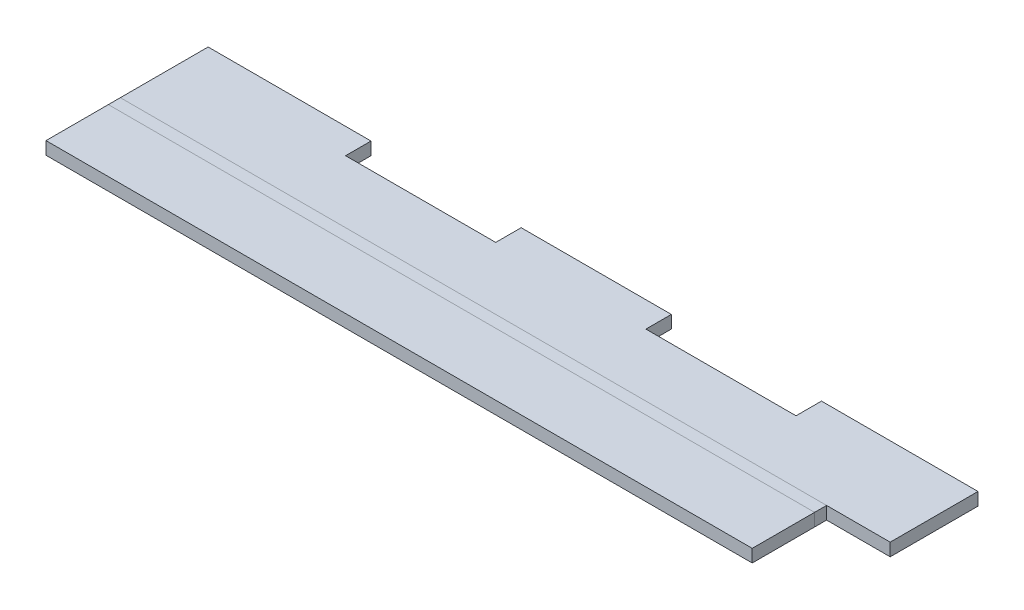
ISO-10303-21;
HEADER;
FILE_DESCRIPTION(('STEP AP214'),'2;1');
FILE_NAME('part.step','',(''),(''),'','','');
FILE_SCHEMA(('AUTOMOTIVE_DESIGN { 1 0 10303 214 1 1 1 1 }'));
ENDSEC;
DATA;
#1=APPLICATION_CONTEXT('core data for automotive mechanical design processes');
#2=APPLICATION_PROTOCOL_DEFINITION('international standard','automotive_design',2000,#1);
#3=PRODUCT_CONTEXT('',#1,'mechanical');
#4=PRODUCT('Part','Part','',(#3));
#5=PRODUCT_RELATED_PRODUCT_CATEGORY('part','',(#4));
#6=PRODUCT_DEFINITION_FORMATION('','',#4);
#7=PRODUCT_DEFINITION_CONTEXT('part definition',#1,'design');
#8=PRODUCT_DEFINITION('design','',#6,#7);
#9=PRODUCT_DEFINITION_SHAPE('','',#8);
#10=(LENGTH_UNIT() NAMED_UNIT(*) SI_UNIT(.MILLI.,.METRE.));
#11=(NAMED_UNIT(*) PLANE_ANGLE_UNIT() SI_UNIT($,.RADIAN.));
#12=(NAMED_UNIT(*) SI_UNIT($,.STERADIAN.) SOLID_ANGLE_UNIT());
#13=UNCERTAINTY_MEASURE_WITH_UNIT(LENGTH_MEASURE(1.E-05),#10,'distance_accuracy_value','');
#14=(GEOMETRIC_REPRESENTATION_CONTEXT(3) GLOBAL_UNCERTAINTY_ASSIGNED_CONTEXT((#13)) GLOBAL_UNIT_ASSIGNED_CONTEXT((#10,
#11,#12)) REPRESENTATION_CONTEXT('',''));
#15=CARTESIAN_POINT('',(0.,0.,0.));
#16=DIRECTION('',(0.,0.,1.));
#17=DIRECTION('',(1.,0.,0.));
#18=AXIS2_PLACEMENT_3D('',#15,#16,#17);
#19=CARTESIAN_POINT('',(7.6835,2.032,-1.96658936020354));
#20=DIRECTION('',(1.,0.,0.));
#21=DIRECTION('',(0.,0.,1.));
#22=AXIS2_PLACEMENT_3D('',#19,#20,#21);
#23=PLANE('',#22);
#24=DIRECTION('',(0.,1.,0.));
#25=VECTOR('',#24,1.);
#26=CARTESIAN_POINT('',(7.6835,2.032,-0.213989360203542));
#27=LINE('',#26,#25);
#28=CARTESIAN_POINT('',(7.6835,1.778,-0.213989360203542));
#29=VERTEX_POINT('',#28);
#30=CARTESIAN_POINT('',(7.6835,2.032,-0.213989360203542));
#31=VERTEX_POINT('',#30);
#32=EDGE_CURVE('E304',#29,#31,#27,.T.);
#33=ORIENTED_EDGE('',*,*,#32,.F.);
#34=DIRECTION('',(0.,0.,1.));
#35=VECTOR('',#34,1.);
#36=CARTESIAN_POINT('',(7.6835,1.778,-1.96658936020354));
#37=LINE('',#36,#35);
#38=CARTESIAN_POINT('',(7.6835,1.778,-1.96658936020354));
#39=VERTEX_POINT('',#38);
#40=EDGE_CURVE('E282',#39,#29,#37,.T.);
#41=ORIENTED_EDGE('',*,*,#40,.F.);
#42=DIRECTION('',(0.,1.,0.));
#43=VECTOR('',#42,1.);
#44=CARTESIAN_POINT('',(7.6835,2.032,-1.96658936020354));
#45=LINE('',#44,#43);
#46=CARTESIAN_POINT('',(7.6835,2.032,-1.96658936020354));
#47=VERTEX_POINT('',#46);
#48=EDGE_CURVE('E302',#39,#47,#45,.T.);
#49=ORIENTED_EDGE('',*,*,#48,.T.);
#50=DIRECTION('',(0.,0.,1.));
#51=VECTOR('',#50,1.);
#52=CARTESIAN_POINT('',(7.6835,2.032,-1.96658936020354));
#53=LINE('',#52,#51);
#54=EDGE_CURVE('E243',#47,#31,#53,.T.);
#55=ORIENTED_EDGE('',*,*,#54,.T.);
#56=EDGE_LOOP('',(#33,#41,#49,#55));
#57=FACE_BOUND('',#56,.T.);
#58=ADVANCED_FACE('F41',(#57),#23,.T.);
#59=CARTESIAN_POINT('',(7.6835,2.032,-1.96658936020354));
#60=DIRECTION('',(0.,0.,1.));
#61=DIRECTION('',(-1.,0.,0.));
#62=AXIS2_PLACEMENT_3D('',#59,#60,#61);
#63=PLANE('',#62);
#64=ORIENTED_EDGE('',*,*,#48,.F.);
#65=DIRECTION('',(1.,0.,0.));
#66=VECTOR('',#65,1.);
#67=CARTESIAN_POINT('',(7.6835,1.778,-1.96658936020354));
#68=LINE('',#67,#66);
#69=CARTESIAN_POINT('',(4.55929999999997,1.778,-1.96658936020354));
#70=VERTEX_POINT('',#69);
#71=EDGE_CURVE('E279',#39,#70,#68,.F.);
#72=ORIENTED_EDGE('',*,*,#71,.T.);
#73=DIRECTION('',(0.,1.,0.));
#74=VECTOR('',#73,1.);
#75=CARTESIAN_POINT('',(4.55929999999997,2.032,-1.96658936020354));
#76=LINE('',#75,#74);
#77=CARTESIAN_POINT('',(4.55929999999997,2.032,-1.96658936020354));
#78=VERTEX_POINT('',#77);
#79=EDGE_CURVE('E300',#70,#78,#76,.T.);
#80=ORIENTED_EDGE('',*,*,#79,.T.);
#81=DIRECTION('',(-1.,0.,0.));
#82=VECTOR('',#81,1.);
#83=CARTESIAN_POINT('',(7.6835,2.032,-1.96658936020354));
#84=LINE('',#83,#82);
#85=EDGE_CURVE('E230',#47,#78,#84,.T.);
#86=ORIENTED_EDGE('',*,*,#85,.F.);
#87=EDGE_LOOP('',(#64,#72,#80,#86));
#88=FACE_BOUND('',#87,.T.);
#89=ADVANCED_FACE('F339',(#88),#63,.F.);
#90=CARTESIAN_POINT('',(4.55929999999997,2.032,-1.96658936020354));
#91=DIRECTION('',(-1.,0.,0.));
#92=DIRECTION('',(0.,0.,-1.));
#93=AXIS2_PLACEMENT_3D('',#90,#91,#92);
#94=PLANE('',#93);
#95=ORIENTED_EDGE('',*,*,#79,.F.);
#96=DIRECTION('',(0.,0.,1.));
#97=VECTOR('',#96,1.);
#98=CARTESIAN_POINT('',(4.55929999999997,1.778,-1.96658936020354));
#99=LINE('',#98,#97);
#100=CARTESIAN_POINT('',(4.55929999999997,1.778,-1.45858936020354));
#101=VERTEX_POINT('',#100);
#102=EDGE_CURVE('E276',#101,#70,#99,.F.);
#103=ORIENTED_EDGE('',*,*,#102,.F.);
#104=DIRECTION('',(0.,1.,0.));
#105=VECTOR('',#104,1.);
#106=CARTESIAN_POINT('',(4.55929999999997,2.032,-1.45858936020354));
#107=LINE('',#106,#105);
#108=CARTESIAN_POINT('',(4.55929999999997,2.032,-1.45858936020354));
#109=VERTEX_POINT('',#108);
#110=EDGE_CURVE('E298',#101,#109,#107,.T.);
#111=ORIENTED_EDGE('',*,*,#110,.T.);
#112=DIRECTION('',(0.,0.,-1.));
#113=VECTOR('',#112,1.);
#114=CARTESIAN_POINT('',(4.55929999999997,2.032,-1.96658936020354));
#115=LINE('',#114,#113);
#116=EDGE_CURVE('E246',#109,#78,#115,.T.);
#117=ORIENTED_EDGE('',*,*,#116,.T.);
#118=EDGE_LOOP('',(#95,#103,#111,#117));
#119=FACE_BOUND('',#118,.T.);
#120=ADVANCED_FACE('F344',(#119),#94,.T.);
#121=CARTESIAN_POINT('',(4.55929999999997,2.032,-1.45858936020354));
#122=DIRECTION('',(0.,0.,-1.));
#123=DIRECTION('',(1.,0.,0.));
#124=AXIS2_PLACEMENT_3D('',#121,#122,#123);
#125=PLANE('',#124);
#126=ORIENTED_EDGE('',*,*,#110,.F.);
#127=DIRECTION('',(1.,0.,0.));
#128=VECTOR('',#127,1.);
#129=CARTESIAN_POINT('',(7.6835,1.778,-1.45858936020354));
#130=LINE('',#129,#128);
#131=CARTESIAN_POINT('',(1.56209999999997,1.778,-1.45858936020354));
#132=VERTEX_POINT('',#131);
#133=EDGE_CURVE('E273',#132,#101,#130,.T.);
#134=ORIENTED_EDGE('',*,*,#133,.F.);
#135=DIRECTION('',(0.,1.,0.));
#136=VECTOR('',#135,1.);
#137=CARTESIAN_POINT('',(1.56209999999997,2.032,-1.45858936020354));
#138=LINE('',#137,#136);
#139=CARTESIAN_POINT('',(1.56209999999997,2.032,-1.45858936020354));
#140=VERTEX_POINT('',#139);
#141=EDGE_CURVE('E296',#132,#140,#138,.T.);
#142=ORIENTED_EDGE('',*,*,#141,.T.);
#143=DIRECTION('',(1.,0.,0.));
#144=VECTOR('',#143,1.);
#145=CARTESIAN_POINT('',(4.55929999999997,2.032,-1.45858936020354));
#146=LINE('',#145,#144);
#147=EDGE_CURVE('E249',#140,#109,#146,.T.);
#148=ORIENTED_EDGE('',*,*,#147,.T.);
#149=EDGE_LOOP('',(#126,#134,#142,#148));
#150=FACE_BOUND('',#149,.T.);
#151=ADVANCED_FACE('F352',(#150),#125,.T.);
#152=CARTESIAN_POINT('',(1.56209999999997,2.032,-1.96658936020354));
#153=DIRECTION('',(1.,0.,0.));
#154=DIRECTION('',(0.,0.,1.));
#155=AXIS2_PLACEMENT_3D('',#152,#153,#154);
#156=PLANE('',#155);
#157=ORIENTED_EDGE('',*,*,#141,.F.);
#158=DIRECTION('',(0.,0.,1.));
#159=VECTOR('',#158,1.);
#160=CARTESIAN_POINT('',(1.56209999999997,1.778,-1.96658936020354));
#161=LINE('',#160,#159);
#162=CARTESIAN_POINT('',(1.56209999999997,1.778,-1.96658936020354));
#163=VERTEX_POINT('',#162);
#164=EDGE_CURVE('E229',#163,#132,#161,.T.);
#165=ORIENTED_EDGE('',*,*,#164,.F.);
#166=DIRECTION('',(0.,1.,0.));
#167=VECTOR('',#166,1.);
#168=CARTESIAN_POINT('',(1.56209999999997,2.032,-1.96658936020354));
#169=LINE('',#168,#167);
#170=CARTESIAN_POINT('',(1.56209999999997,2.032,-1.96658936020354));
#171=VERTEX_POINT('',#170);
#172=EDGE_CURVE('E294',#163,#171,#169,.T.);
#173=ORIENTED_EDGE('',*,*,#172,.T.);
#174=DIRECTION('',(0.,0.,1.));
#175=VECTOR('',#174,1.);
#176=CARTESIAN_POINT('',(1.56209999999997,2.032,-1.96658936020354));
#177=LINE('',#176,#175);
#178=EDGE_CURVE('E252',#171,#140,#177,.T.);
#179=ORIENTED_EDGE('',*,*,#178,.T.);
#180=EDGE_LOOP('',(#157,#165,#173,#179));
#181=FACE_BOUND('',#180,.T.);
#182=ADVANCED_FACE('F356',(#181),#156,.T.);
#183=ORIENTED_EDGE('',*,*,#172,.F.);
#184=DIRECTION('',(1.,0.,0.));
#185=VECTOR('',#184,1.);
#186=CARTESIAN_POINT('',(7.6835,1.778,-1.96658936020354));
#187=LINE('',#186,#185);
#188=CARTESIAN_POINT('',(-1.43510000000003,1.778,-1.96658936020354));
#189=VERTEX_POINT('',#188);
#190=EDGE_CURVE('E212',#163,#189,#187,.F.);
#191=ORIENTED_EDGE('',*,*,#190,.T.);
#192=DIRECTION('',(0.,1.,0.));
#193=VECTOR('',#192,1.);
#194=CARTESIAN_POINT('',(-1.43510000000003,2.032,-1.96658936020354));
#195=LINE('',#194,#193);
#196=CARTESIAN_POINT('',(-1.43510000000003,2.032,-1.96658936020354));
#197=VERTEX_POINT('',#196);
#198=EDGE_CURVE('E292',#189,#197,#195,.T.);
#199=ORIENTED_EDGE('',*,*,#198,.T.);
#200=EDGE_CURVE('E225',#171,#197,#84,.T.);
#201=ORIENTED_EDGE('',*,*,#200,.F.);
#202=EDGE_LOOP('',(#183,#191,#199,#201));
#203=FACE_BOUND('',#202,.T.);
#204=ADVANCED_FACE('F347',(#203),#63,.F.);
#205=CARTESIAN_POINT('',(-1.43510000000003,2.032,-1.96658936020354));
#206=DIRECTION('',(-1.,0.,0.));
#207=DIRECTION('',(0.,0.,-1.));
#208=AXIS2_PLACEMENT_3D('',#205,#206,#207);
#209=PLANE('',#208);
#210=ORIENTED_EDGE('',*,*,#198,.F.);
#211=DIRECTION('',(0.,0.,1.));
#212=VECTOR('',#211,1.);
#213=CARTESIAN_POINT('',(-1.43510000000003,1.778,-1.96658936020354));
#214=LINE('',#213,#212);
#215=CARTESIAN_POINT('',(-1.43510000000003,1.778,-1.45858936020354));
#216=VERTEX_POINT('',#215);
#217=EDGE_CURVE('E266',#216,#189,#214,.F.);
#218=ORIENTED_EDGE('',*,*,#217,.F.);
#219=DIRECTION('',(0.,1.,0.));
#220=VECTOR('',#219,1.);
#221=CARTESIAN_POINT('',(-1.43510000000003,2.032,-1.45858936020354));
#222=LINE('',#221,#220);
#223=CARTESIAN_POINT('',(-1.43510000000003,2.032,-1.45858936020354));
#224=VERTEX_POINT('',#223);
#225=EDGE_CURVE('E290',#216,#224,#222,.T.);
#226=ORIENTED_EDGE('',*,*,#225,.T.);
#227=DIRECTION('',(0.,0.,-1.));
#228=VECTOR('',#227,1.);
#229=CARTESIAN_POINT('',(-1.43510000000003,2.032,-1.96658936020354));
#230=LINE('',#229,#228);
#231=EDGE_CURVE('E228',#224,#197,#230,.T.);
#232=ORIENTED_EDGE('',*,*,#231,.T.);
#233=EDGE_LOOP('',(#210,#218,#226,#232));
#234=FACE_BOUND('',#233,.T.);
#235=ADVANCED_FACE('F361',(#234),#209,.T.);
#236=CARTESIAN_POINT('',(-4.43230000000003,2.032,-1.45858936020354));
#237=DIRECTION('',(0.,0.,-1.));
#238=DIRECTION('',(1.,0.,0.));
#239=AXIS2_PLACEMENT_3D('',#236,#237,#238);
#240=PLANE('',#239);
#241=ORIENTED_EDGE('',*,*,#225,.F.);
#242=DIRECTION('',(1.,0.,0.));
#243=VECTOR('',#242,1.);
#244=CARTESIAN_POINT('',(7.6835,1.778,-1.45858936020354));
#245=LINE('',#244,#243);
#246=CARTESIAN_POINT('',(-4.43230000000003,1.778,-1.45858936020354));
#247=VERTEX_POINT('',#246);
#248=EDGE_CURVE('E263',#247,#216,#245,.T.);
#249=ORIENTED_EDGE('',*,*,#248,.F.);
#250=DIRECTION('',(0.,1.,0.));
#251=VECTOR('',#250,1.);
#252=CARTESIAN_POINT('',(-4.43230000000003,2.032,-1.45858936020354));
#253=LINE('',#252,#251);
#254=CARTESIAN_POINT('',(-4.43230000000003,2.032,-1.45858936020354));
#255=VERTEX_POINT('',#254);
#256=EDGE_CURVE('E288',#247,#255,#253,.T.);
#257=ORIENTED_EDGE('',*,*,#256,.T.);
#258=DIRECTION('',(1.,0.,0.));
#259=VECTOR('',#258,1.);
#260=CARTESIAN_POINT('',(-4.43230000000003,2.032,-1.45858936020354));
#261=LINE('',#260,#259);
#262=EDGE_CURVE('E234',#255,#224,#261,.T.);
#263=ORIENTED_EDGE('',*,*,#262,.T.);
#264=EDGE_LOOP('',(#241,#249,#257,#263));
#265=FACE_BOUND('',#264,.T.);
#266=ADVANCED_FACE('F364',(#265),#240,.T.);
#267=CARTESIAN_POINT('',(-4.43230000000003,2.032,-1.96658936020354));
#268=DIRECTION('',(1.,0.,0.));
#269=DIRECTION('',(0.,0.,1.));
#270=AXIS2_PLACEMENT_3D('',#267,#268,#269);
#271=PLANE('',#270);
#272=ORIENTED_EDGE('',*,*,#256,.F.);
#273=DIRECTION('',(0.,0.,1.));
#274=VECTOR('',#273,1.);
#275=CARTESIAN_POINT('',(-4.43230000000003,1.778,-1.96658936020354));
#276=LINE('',#275,#274);
#277=CARTESIAN_POINT('',(-4.43230000000003,1.778,-1.96658936020354));
#278=VERTEX_POINT('',#277);
#279=EDGE_CURVE('E260',#278,#247,#276,.T.);
#280=ORIENTED_EDGE('',*,*,#279,.F.);
#281=DIRECTION('',(0.,1.,0.));
#282=VECTOR('',#281,1.);
#283=CARTESIAN_POINT('',(-4.43230000000003,2.032,-1.96658936020354));
#284=LINE('',#283,#282);
#285=CARTESIAN_POINT('',(-4.43230000000003,2.032,-1.96658936020354));
#286=VERTEX_POINT('',#285);
#287=EDGE_CURVE('E286',#278,#286,#284,.T.);
#288=ORIENTED_EDGE('',*,*,#287,.T.);
#289=DIRECTION('',(0.,0.,1.));
#290=VECTOR('',#289,1.);
#291=CARTESIAN_POINT('',(-4.43230000000003,2.032,-1.96658936020354));
#292=LINE('',#291,#290);
#293=EDGE_CURVE('E237',#286,#255,#292,.T.);
#294=ORIENTED_EDGE('',*,*,#293,.T.);
#295=EDGE_LOOP('',(#272,#280,#288,#294));
#296=FACE_BOUND('',#295,.T.);
#297=ADVANCED_FACE('F368',(#296),#271,.T.);
#298=ORIENTED_EDGE('',*,*,#287,.F.);
#299=DIRECTION('',(1.,0.,0.));
#300=VECTOR('',#299,1.);
#301=CARTESIAN_POINT('',(7.6835,1.778,-1.96658936020354));
#302=LINE('',#301,#300);
#303=CARTESIAN_POINT('',(-7.6835,1.778,-1.96658936020354));
#304=VERTEX_POINT('',#303);
#305=EDGE_CURVE('E257',#278,#304,#302,.F.);
#306=ORIENTED_EDGE('',*,*,#305,.T.);
#307=DIRECTION('',(0.,1.,0.));
#308=VECTOR('',#307,1.);
#309=CARTESIAN_POINT('',(-7.6835,2.032,-1.96658936020354));
#310=LINE('',#309,#308);
#311=CARTESIAN_POINT('',(-7.6835,2.032,-1.96658936020354));
#312=VERTEX_POINT('',#311);
#313=EDGE_CURVE('E255',#304,#312,#310,.T.);
#314=ORIENTED_EDGE('',*,*,#313,.T.);
#315=EDGE_CURVE('E231',#286,#312,#84,.T.);
#316=ORIENTED_EDGE('',*,*,#315,.F.);
#317=EDGE_LOOP('',(#298,#306,#314,#316));
#318=FACE_BOUND('',#317,.T.);
#319=ADVANCED_FACE('F348',(#318),#63,.F.);
#320=CARTESIAN_POINT('',(-7.6835,2.032,-1.96658936020354));
#321=DIRECTION('',(1.,0.,0.));
#322=DIRECTION('',(0.,0.,1.));
#323=AXIS2_PLACEMENT_3D('',#320,#321,#322);
#324=PLANE('',#323);
#325=ORIENTED_EDGE('',*,*,#313,.F.);
#326=DIRECTION('',(0.,0.,1.));
#327=VECTOR('',#326,1.);
#328=CARTESIAN_POINT('',(-7.6835,1.778,-1.96658936020354));
#329=LINE('',#328,#327);
#330=CARTESIAN_POINT('',(-7.6835,1.778,-0.213989360203542));
#331=VERTEX_POINT('',#330);
#332=EDGE_CURVE('E65',#304,#331,#329,.T.);
#333=ORIENTED_EDGE('',*,*,#332,.T.);
#334=DIRECTION('',(0.,1.,0.));
#335=VECTOR('',#334,1.);
#336=CARTESIAN_POINT('',(-7.6835,2.032,-0.213989360203542));
#337=LINE('',#336,#335);
#338=CARTESIAN_POINT('',(-7.6835,2.032,-0.213989360203542));
#339=VERTEX_POINT('',#338);
#340=EDGE_CURVE('E307',#331,#339,#337,.T.);
#341=ORIENTED_EDGE('',*,*,#340,.T.);
#342=DIRECTION('',(0.,0.,1.));
#343=VECTOR('',#342,1.);
#344=CARTESIAN_POINT('',(-7.6835,2.032,-1.96658936020354));
#345=LINE('',#344,#343);
#346=EDGE_CURVE('E240',#312,#339,#345,.T.);
#347=ORIENTED_EDGE('',*,*,#346,.F.);
#348=EDGE_LOOP('',(#325,#333,#341,#347));
#349=FACE_BOUND('',#348,.T.);
#350=ADVANCED_FACE('F374',(#349),#324,.F.);
#351=CARTESIAN_POINT('',(7.6835,2.032,-0.213989360203542));
#352=DIRECTION('',(0.,0.,1.));
#353=DIRECTION('',(-1.,0.,0.));
#354=AXIS2_PLACEMENT_3D('',#351,#352,#353);
#355=PLANE('',#354);
#356=DIRECTION('',(1.,0.,0.));
#357=VECTOR('',#356,1.);
#358=CARTESIAN_POINT('',(7.6835,1.778,-0.213989360203542));
#359=LINE('',#358,#357);
#360=CARTESIAN_POINT('',(6.4135,1.778,-0.213989360203542));
#361=VERTEX_POINT('',#360);
#362=EDGE_CURVE('E57',#29,#361,#359,.F.);
#363=ORIENTED_EDGE('',*,*,#362,.F.);
#364=ORIENTED_EDGE('',*,*,#32,.T.);
#365=DIRECTION('',(-1.,0.,0.));
#366=VECTOR('',#365,1.);
#367=CARTESIAN_POINT('',(7.6835,2.032,-0.213989360203542));
#368=LINE('',#367,#366);
#369=CARTESIAN_POINT('',(6.4135,2.032,-0.213989360203542));
#370=VERTEX_POINT('',#369);
#371=EDGE_CURVE('E45',#31,#370,#368,.T.);
#372=ORIENTED_EDGE('',*,*,#371,.T.);
#373=DIRECTION('',(0.,1.,0.));
#374=VECTOR('',#373,1.);
#375=CARTESIAN_POINT('',(6.4135,2.032,-0.213989360203542));
#376=LINE('',#375,#374);
#377=EDGE_CURVE('E11',#361,#370,#376,.T.);
#378=ORIENTED_EDGE('',*,*,#377,.F.);
#379=EDGE_LOOP('',(#363,#364,#372,#378));
#380=FACE_BOUND('',#379,.T.);
#381=ADVANCED_FACE('F43',(#380),#355,.T.);
#382=CARTESIAN_POINT('',(7.6835,2.032,-1.96658936020354));
#383=DIRECTION('',(0.,-1.,0.));
#384=DIRECTION('',(1.,0.,0.));
#385=AXIS2_PLACEMENT_3D('',#382,#383,#384);
#386=PLANE('',#385);
#387=ORIENTED_EDGE('',*,*,#200,.T.);
#388=ORIENTED_EDGE('',*,*,#231,.F.);
#389=ORIENTED_EDGE('',*,*,#262,.F.);
#390=ORIENTED_EDGE('',*,*,#293,.F.);
#391=ORIENTED_EDGE('',*,*,#315,.T.);
#392=ORIENTED_EDGE('',*,*,#346,.T.);
#393=DIRECTION('',(-1.,0.,0.));
#394=VECTOR('',#393,1.);
#395=CARTESIAN_POINT('',(7.6835,2.032,-0.213989360203542));
#396=LINE('',#395,#394);
#397=EDGE_CURVE('E201',#370,#339,#396,.T.);
#398=ORIENTED_EDGE('',*,*,#397,.F.);
#399=ORIENTED_EDGE('',*,*,#371,.F.);
#400=ORIENTED_EDGE('',*,*,#54,.F.);
#401=ORIENTED_EDGE('',*,*,#85,.T.);
#402=ORIENTED_EDGE('',*,*,#116,.F.);
#403=ORIENTED_EDGE('',*,*,#147,.F.);
#404=ORIENTED_EDGE('',*,*,#178,.F.);
#405=EDGE_LOOP('',(#387,#388,#389,#390,#391,#392,#398,#399,#400,#401,#402,#403,#404));
#406=FACE_BOUND('',#405,.T.);
#407=ADVANCED_FACE('F335',(#406),#386,.F.);
#408=CARTESIAN_POINT('',(7.6835,1.778,-1.96658936020354));
#409=DIRECTION('',(0.,-1.,0.));
#410=DIRECTION('',(1.,0.,0.));
#411=AXIS2_PLACEMENT_3D('',#408,#409,#410);
#412=PLANE('',#411);
#413=ORIENTED_EDGE('',*,*,#190,.F.);
#414=ORIENTED_EDGE('',*,*,#164,.T.);
#415=ORIENTED_EDGE('',*,*,#133,.T.);
#416=ORIENTED_EDGE('',*,*,#102,.T.);
#417=ORIENTED_EDGE('',*,*,#71,.F.);
#418=ORIENTED_EDGE('',*,*,#40,.T.);
#419=ORIENTED_EDGE('',*,*,#362,.T.);
#420=DIRECTION('',(-1.,0.,0.));
#421=VECTOR('',#420,1.);
#422=CARTESIAN_POINT('',(7.6835,1.778,-0.213989360203542));
#423=LINE('',#422,#421);
#424=EDGE_CURVE('E50',#361,#331,#423,.T.);
#425=ORIENTED_EDGE('',*,*,#424,.T.);
#426=ORIENTED_EDGE('',*,*,#332,.F.);
#427=ORIENTED_EDGE('',*,*,#305,.F.);
#428=ORIENTED_EDGE('',*,*,#279,.T.);
#429=ORIENTED_EDGE('',*,*,#248,.T.);
#430=ORIENTED_EDGE('',*,*,#217,.T.);
#431=EDGE_LOOP('',(#413,#414,#415,#416,#417,#418,#419,#425,#426,#427,#428,#429,#430));
#432=FACE_BOUND('',#431,.T.);
#433=ADVANCED_FACE('F311',(#432),#412,.T.);
#434=CARTESIAN_POINT('',(7.6835,2.032,1.27));
#435=DIRECTION('',(0.,0.,1.));
#436=DIRECTION('',(-1.,0.,0.));
#437=AXIS2_PLACEMENT_3D('',#434,#435,#436);
#438=PLANE('',#437);
#439=DIRECTION('',(0.,1.,0.));
#440=VECTOR('',#439,1.);
#441=CARTESIAN_POINT('',(-7.6835,2.032,1.27));
#442=LINE('',#441,#440);
#443=CARTESIAN_POINT('',(-7.6835,1.778,1.27));
#444=VERTEX_POINT('',#443);
#445=CARTESIAN_POINT('',(-7.6835,2.032,1.27));
#446=VERTEX_POINT('',#445);
#447=EDGE_CURVE('E184',#444,#446,#442,.T.);
#448=ORIENTED_EDGE('',*,*,#447,.F.);
#449=DIRECTION('',(1.,0.,0.));
#450=VECTOR('',#449,1.);
#451=CARTESIAN_POINT('',(7.6835,1.778,1.27));
#452=LINE('',#451,#450);
#453=CARTESIAN_POINT('',(6.4135,1.778,1.27));
#454=VERTEX_POINT('',#453);
#455=EDGE_CURVE('E218',#454,#444,#452,.F.);
#456=ORIENTED_EDGE('',*,*,#455,.F.);
#457=DIRECTION('',(0.,1.,0.));
#458=VECTOR('',#457,1.);
#459=CARTESIAN_POINT('',(6.4135,2.032,1.27));
#460=LINE('',#459,#458);
#461=CARTESIAN_POINT('',(6.4135,2.032,1.27));
#462=VERTEX_POINT('',#461);
#463=EDGE_CURVE('E195',#454,#462,#460,.T.);
#464=ORIENTED_EDGE('',*,*,#463,.T.);
#465=DIRECTION('',(-1.,0.,0.));
#466=VECTOR('',#465,1.);
#467=CARTESIAN_POINT('',(7.6835,2.032,1.27));
#468=LINE('',#467,#466);
#469=EDGE_CURVE('E175',#462,#446,#468,.T.);
#470=ORIENTED_EDGE('',*,*,#469,.T.);
#471=EDGE_LOOP('',(#448,#456,#464,#470));
#472=FACE_BOUND('',#471,.T.);
#473=ADVANCED_FACE('F327',(#472),#438,.T.);
#474=CARTESIAN_POINT('',(7.6835,2.032,0.0254000000000001));
#475=DIRECTION('',(0.,-1.,0.));
#476=DIRECTION('',(0.,0.,-1.));
#477=AXIS2_PLACEMENT_3D('',#474,#475,#476);
#478=PLANE('',#477);
#479=ORIENTED_EDGE('',*,*,#469,.F.);
#480=DIRECTION('',(0.,0.,1.));
#481=VECTOR('',#480,1.);
#482=CARTESIAN_POINT('',(6.4135,2.032,1.27));
#483=LINE('',#482,#481);
#484=CARTESIAN_POINT('',(6.4135,2.032,0.0254000000000001));
#485=VERTEX_POINT('',#484);
#486=EDGE_CURVE('E169',#485,#462,#483,.T.);
#487=ORIENTED_EDGE('',*,*,#486,.F.);
#488=DIRECTION('',(-1.,0.,0.));
#489=VECTOR('',#488,1.);
#490=CARTESIAN_POINT('',(7.6835,2.032,0.0254000000000001));
#491=LINE('',#490,#489);
#492=CARTESIAN_POINT('',(-7.6835,2.032,0.0254000000000001));
#493=VERTEX_POINT('',#492);
#494=EDGE_CURVE('E162',#485,#493,#491,.T.);
#495=ORIENTED_EDGE('',*,*,#494,.T.);
#496=DIRECTION('',(0.,0.,1.));
#497=VECTOR('',#496,1.);
#498=CARTESIAN_POINT('',(-7.6835,2.032,0.0254000000000001));
#499=LINE('',#498,#497);
#500=EDGE_CURVE('E166',#493,#446,#499,.T.);
#501=ORIENTED_EDGE('',*,*,#500,.T.);
#502=EDGE_LOOP('',(#479,#487,#495,#501));
#503=FACE_BOUND('',#502,.T.);
#504=ADVANCED_FACE('F165',(#503),#478,.F.);
#505=CARTESIAN_POINT('',(-7.6835,2.032,0.0254000000000001));
#506=DIRECTION('',(1.,0.,0.));
#507=DIRECTION('',(0.,0.,1.));
#508=AXIS2_PLACEMENT_3D('',#505,#506,#507);
#509=PLANE('',#508);
#510=DIRECTION('',(0.,1.,0.));
#511=VECTOR('',#510,1.);
#512=CARTESIAN_POINT('',(-7.6835,2.032,0.0254000000000001));
#513=LINE('',#512,#511);
#514=CARTESIAN_POINT('',(-7.6835,1.778,0.0254));
#515=VERTEX_POINT('',#514);
#516=EDGE_CURVE('E182',#515,#493,#513,.T.);
#517=ORIENTED_EDGE('',*,*,#516,.F.);
#518=DIRECTION('',(0.,0.,-1.));
#519=VECTOR('',#518,1.);
#520=CARTESIAN_POINT('',(-7.6835,1.778,0.0254));
#521=LINE('',#520,#519);
#522=EDGE_CURVE('E185',#515,#444,#521,.F.);
#523=ORIENTED_EDGE('',*,*,#522,.T.);
#524=ORIENTED_EDGE('',*,*,#447,.T.);
#525=ORIENTED_EDGE('',*,*,#500,.F.);
#526=EDGE_LOOP('',(#517,#523,#524,#525));
#527=FACE_BOUND('',#526,.T.);
#528=ADVANCED_FACE('F180',(#527),#509,.F.);
#529=CARTESIAN_POINT('',(7.6835,1.778,0.0254));
#530=DIRECTION('',(0.,-1.,0.));
#531=DIRECTION('',(0.,0.,-1.));
#532=AXIS2_PLACEMENT_3D('',#529,#530,#531);
#533=PLANE('',#532);
#534=ORIENTED_EDGE('',*,*,#455,.T.);
#535=ORIENTED_EDGE('',*,*,#522,.F.);
#536=DIRECTION('',(-1.,0.,0.));
#537=VECTOR('',#536,1.);
#538=CARTESIAN_POINT('',(7.6835,1.778,0.0254));
#539=LINE('',#538,#537);
#540=CARTESIAN_POINT('',(6.4135,1.778,0.0254));
#541=VERTEX_POINT('',#540);
#542=EDGE_CURVE('E196',#541,#515,#539,.T.);
#543=ORIENTED_EDGE('',*,*,#542,.F.);
#544=DIRECTION('',(0.,0.,-1.));
#545=VECTOR('',#544,1.);
#546=CARTESIAN_POINT('',(6.4135,1.778,0.0254));
#547=LINE('',#546,#545);
#548=EDGE_CURVE('E215',#541,#454,#547,.F.);
#549=ORIENTED_EDGE('',*,*,#548,.T.);
#550=EDGE_LOOP('',(#534,#535,#543,#549));
#551=FACE_BOUND('',#550,.T.);
#552=ADVANCED_FACE('F320',(#551),#533,.T.);
#553=CARTESIAN_POINT('',(6.4135,2.032,1.27));
#554=DIRECTION('',(1.,0.,0.));
#555=DIRECTION('',(0.,0.,1.));
#556=AXIS2_PLACEMENT_3D('',#553,#554,#555);
#557=PLANE('',#556);
#558=ORIENTED_EDGE('',*,*,#463,.F.);
#559=ORIENTED_EDGE('',*,*,#548,.F.);
#560=DIRECTION('',(0.,1.,0.));
#561=VECTOR('',#560,1.);
#562=CARTESIAN_POINT('',(6.4135,2.032,0.0254000000000001));
#563=LINE('',#562,#561);
#564=EDGE_CURVE('E213',#541,#485,#563,.T.);
#565=ORIENTED_EDGE('',*,*,#564,.T.);
#566=ORIENTED_EDGE('',*,*,#486,.T.);
#567=EDGE_LOOP('',(#558,#559,#565,#566));
#568=FACE_BOUND('',#567,.T.);
#569=ADVANCED_FACE('F325',(#568),#557,.T.);
#570=CARTESIAN_POINT('',(6.4135,2.032,0.0254000000000001));
#571=DIRECTION('',(1.,0.,0.));
#572=DIRECTION('',(0.,0.,-1.));
#573=AXIS2_PLACEMENT_3D('',#570,#571,#572);
#574=PLANE('',#573);
#575=ORIENTED_EDGE('',*,*,#564,.F.);
#576=DIRECTION('',(0.,0.,1.));
#577=VECTOR('',#576,1.);
#578=CARTESIAN_POINT('',(6.4135,1.778,-0.0942946801017711));
#579=LINE('',#578,#577);
#580=EDGE_CURVE('E207',#541,#361,#579,.F.);
#581=ORIENTED_EDGE('',*,*,#580,.T.);
#582=ORIENTED_EDGE('',*,*,#377,.T.);
#583=DIRECTION('',(0.,0.,-1.));
#584=VECTOR('',#583,1.);
#585=CARTESIAN_POINT('',(6.4135,2.032,0.0254000000000001));
#586=LINE('',#585,#584);
#587=EDGE_CURVE('E202',#485,#370,#586,.T.);
#588=ORIENTED_EDGE('',*,*,#587,.F.);
#589=EDGE_LOOP('',(#575,#581,#582,#588));
#590=FACE_BOUND('',#589,.T.);
#591=ADVANCED_FACE('F323',(#590),#574,.T.);
#592=CARTESIAN_POINT('',(-7.6835,2.032,-0.213989360203542));
#593=DIRECTION('',(-1.,0.,0.));
#594=DIRECTION('',(0.,0.,1.));
#595=AXIS2_PLACEMENT_3D('',#592,#593,#594);
#596=PLANE('',#595);
#597=DIRECTION('',(0.,0.,1.));
#598=VECTOR('',#597,1.);
#599=CARTESIAN_POINT('',(-7.6835,1.778,-0.0942946801017711));
#600=LINE('',#599,#598);
#601=EDGE_CURVE('E194',#331,#515,#600,.T.);
#602=ORIENTED_EDGE('',*,*,#601,.T.);
#603=ORIENTED_EDGE('',*,*,#516,.T.);
#604=DIRECTION('',(0.,0.,1.));
#605=VECTOR('',#604,1.);
#606=CARTESIAN_POINT('',(-7.6835,2.032,-0.213989360203542));
#607=LINE('',#606,#605);
#608=EDGE_CURVE('E192',#339,#493,#607,.T.);
#609=ORIENTED_EDGE('',*,*,#608,.F.);
#610=ORIENTED_EDGE('',*,*,#340,.F.);
#611=EDGE_LOOP('',(#602,#603,#609,#610));
#612=FACE_BOUND('',#611,.T.);
#613=ADVANCED_FACE('F190',(#612),#596,.T.);
#614=CARTESIAN_POINT('',(-0.635,2.032,-0.0942946801017711));
#615=DIRECTION('',(0.,1.,0.));
#616=DIRECTION('',(0.,0.,1.));
#617=AXIS2_PLACEMENT_3D('',#614,#615,#616);
#618=PLANE('',#617);
#619=ORIENTED_EDGE('',*,*,#397,.T.);
#620=ORIENTED_EDGE('',*,*,#608,.T.);
#621=ORIENTED_EDGE('',*,*,#494,.F.);
#622=ORIENTED_EDGE('',*,*,#587,.T.);
#623=EDGE_LOOP('',(#619,#620,#621,#622));
#624=FACE_BOUND('',#623,.T.);
#625=ADVANCED_FACE('F199',(#624),#618,.T.);
#626=CARTESIAN_POINT('',(-0.635,1.778,-0.0942946801017711));
#627=DIRECTION('',(0.,1.,0.));
#628=DIRECTION('',(0.,0.,1.));
#629=AXIS2_PLACEMENT_3D('',#626,#627,#628);
#630=PLANE('',#629);
#631=ORIENTED_EDGE('',*,*,#424,.F.);
#632=ORIENTED_EDGE('',*,*,#580,.F.);
#633=ORIENTED_EDGE('',*,*,#542,.T.);
#634=ORIENTED_EDGE('',*,*,#601,.F.);
#635=EDGE_LOOP('',(#631,#632,#633,#634));
#636=FACE_BOUND('',#635,.T.);
#637=ADVANCED_FACE('F316',(#636),#630,.F.);
#638=CLOSED_SHELL('',(#58,#89,#120,#151,#182,#204,#235,#266,#297,#319,#350,#381,#407,#433,#473,
#504,#528,#552,#569,#591,#613,#625,#637));
#639=MANIFOLD_SOLID_BREP('B2',#638);
#640=ADVANCED_BREP_SHAPE_REPRESENTATION('',(#18,#639),#14);
#641=SHAPE_DEFINITION_REPRESENTATION(#9,#640);
ENDSEC;
END-ISO-10303-21;
